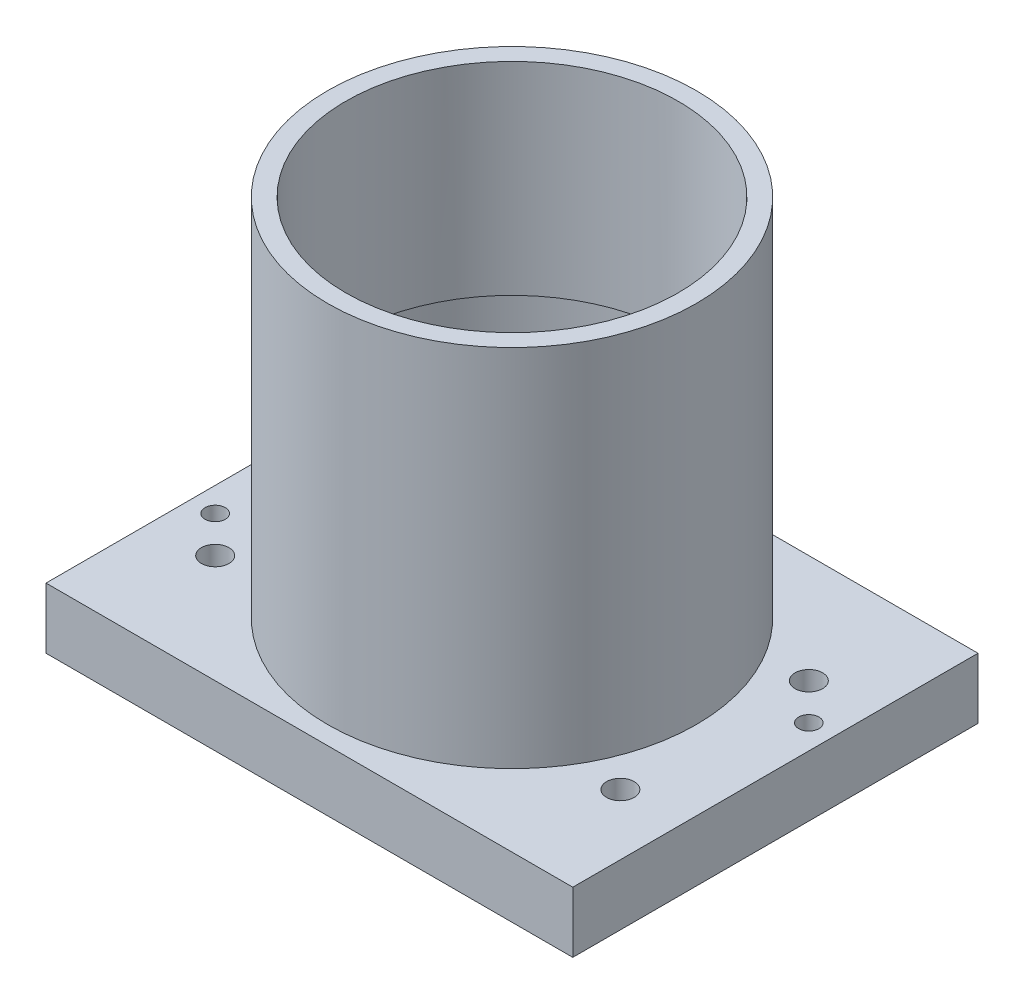
ISO-10303-21;
HEADER;
FILE_DESCRIPTION(('STEP AP214'),'2;1');
FILE_NAME('part.step','',(''),(''),'','','');
FILE_SCHEMA(('AUTOMOTIVE_DESIGN { 1 0 10303 214 1 1 1 1 }'));
ENDSEC;
DATA;
#1=APPLICATION_CONTEXT('core data for automotive mechanical design processes');
#2=APPLICATION_PROTOCOL_DEFINITION('international standard','automotive_design',2000,#1);
#3=PRODUCT_CONTEXT('',#1,'mechanical');
#4=PRODUCT('Part','Part','',(#3));
#5=PRODUCT_RELATED_PRODUCT_CATEGORY('part','',(#4));
#6=PRODUCT_DEFINITION_FORMATION('','',#4);
#7=PRODUCT_DEFINITION_CONTEXT('part definition',#1,'design');
#8=PRODUCT_DEFINITION('design','',#6,#7);
#9=PRODUCT_DEFINITION_SHAPE('','',#8);
#10=(LENGTH_UNIT() NAMED_UNIT(*) SI_UNIT(.MILLI.,.METRE.));
#11=(NAMED_UNIT(*) PLANE_ANGLE_UNIT() SI_UNIT($,.RADIAN.));
#12=(NAMED_UNIT(*) SI_UNIT($,.STERADIAN.) SOLID_ANGLE_UNIT());
#13=UNCERTAINTY_MEASURE_WITH_UNIT(LENGTH_MEASURE(1.E-05),#10,'distance_accuracy_value','');
#14=(GEOMETRIC_REPRESENTATION_CONTEXT(3) GLOBAL_UNCERTAINTY_ASSIGNED_CONTEXT((#13)) GLOBAL_UNIT_ASSIGNED_CONTEXT((#10,
#11,#12)) REPRESENTATION_CONTEXT('',''));
#15=CARTESIAN_POINT('',(0.,0.,0.));
#16=DIRECTION('',(0.,0.,1.));
#17=DIRECTION('',(1.,0.,0.));
#18=AXIS2_PLACEMENT_3D('',#15,#16,#17);
#19=CARTESIAN_POINT('',(0.,0.,0.));
#20=DIRECTION('',(0.,1.,0.));
#21=DIRECTION('',(0.,0.,1.));
#22=AXIS2_PLACEMENT_3D('',#19,#20,#21);
#23=CYLINDRICAL_SURFACE('',#22,41.);
#24=CARTESIAN_POINT('',(0.,105.,0.));
#25=DIRECTION('',(0.,1.,0.));
#26=DIRECTION('',(0.,0.,1.));
#27=AXIS2_PLACEMENT_3D('',#24,#25,#26);
#28=CIRCLE('',#27,41.);
#29=CARTESIAN_POINT('',(0.,105.,41.));
#30=VERTEX_POINT('',#29);
#31=EDGE_CURVE('E140',#30,#30,#28,.T.);
#32=ORIENTED_EDGE('',*,*,#31,.T.);
#33=EDGE_LOOP('',(#32));
#34=FACE_BOUND('',#33,.T.);
#35=CARTESIAN_POINT('',(0.,55.,0.));
#36=DIRECTION('',(0.,-1.,0.));
#37=DIRECTION('',(0.,0.,-1.));
#38=AXIS2_PLACEMENT_3D('',#35,#36,#37);
#39=CIRCLE('',#38,41.);
#40=CARTESIAN_POINT('',(0.,55.,-41.));
#41=VERTEX_POINT('',#40);
#42=EDGE_CURVE('E136',#41,#41,#39,.F.);
#43=ORIENTED_EDGE('',*,*,#42,.F.);
#44=EDGE_LOOP('',(#43));
#45=FACE_BOUND('',#44,.T.);
#46=ADVANCED_FACE('F44',(#34,#45),#23,.F.);
#47=CARTESIAN_POINT('',(65.,15.,50.));
#48=DIRECTION('',(-1.,0.,0.));
#49=DIRECTION('',(0.,0.,1.));
#50=AXIS2_PLACEMENT_3D('',#47,#48,#49);
#51=PLANE('',#50);
#52=DIRECTION('',(0.,0.,-1.));
#53=VECTOR('',#52,1.);
#54=CARTESIAN_POINT('',(65.,0.,50.));
#55=LINE('',#54,#53);
#56=CARTESIAN_POINT('',(65.,0.,50.));
#57=VERTEX_POINT('',#56);
#58=CARTESIAN_POINT('',(65.,0.,-50.));
#59=VERTEX_POINT('',#58);
#60=EDGE_CURVE('E119',#57,#59,#55,.T.);
#61=ORIENTED_EDGE('',*,*,#60,.T.);
#62=DIRECTION('',(0.,-1.,0.));
#63=VECTOR('',#62,1.);
#64=CARTESIAN_POINT('',(65.,15.,-50.));
#65=LINE('',#64,#63);
#66=CARTESIAN_POINT('',(65.,15.,-50.));
#67=VERTEX_POINT('',#66);
#68=EDGE_CURVE('E55',#67,#59,#65,.T.);
#69=ORIENTED_EDGE('',*,*,#68,.F.);
#70=DIRECTION('',(0.,0.,-1.));
#71=VECTOR('',#70,1.);
#72=CARTESIAN_POINT('',(65.,15.,50.));
#73=LINE('',#72,#71);
#74=CARTESIAN_POINT('',(65.,15.,50.));
#75=VERTEX_POINT('',#74);
#76=EDGE_CURVE('E100',#75,#67,#73,.T.);
#77=ORIENTED_EDGE('',*,*,#76,.F.);
#78=DIRECTION('',(0.,-1.,0.));
#79=VECTOR('',#78,1.);
#80=CARTESIAN_POINT('',(65.,15.,50.));
#81=LINE('',#80,#79);
#82=EDGE_CURVE('E115',#75,#57,#81,.T.);
#83=ORIENTED_EDGE('',*,*,#82,.T.);
#84=EDGE_LOOP('',(#61,#69,#77,#83));
#85=FACE_BOUND('',#84,.T.);
#86=ADVANCED_FACE('F46',(#85),#51,.F.);
#87=CARTESIAN_POINT('',(-65.,15.,-50.));
#88=DIRECTION('',(0.,0.,1.));
#89=DIRECTION('',(1.,0.,0.));
#90=AXIS2_PLACEMENT_3D('',#87,#88,#89);
#91=PLANE('',#90);
#92=DIRECTION('',(-1.,0.,0.));
#93=VECTOR('',#92,1.);
#94=CARTESIAN_POINT('',(-65.,0.,-50.));
#95=LINE('',#94,#93);
#96=CARTESIAN_POINT('',(-65.,0.,-50.));
#97=VERTEX_POINT('',#96);
#98=EDGE_CURVE('E106',#59,#97,#95,.T.);
#99=ORIENTED_EDGE('',*,*,#98,.T.);
#100=DIRECTION('',(0.,-1.,0.));
#101=VECTOR('',#100,1.);
#102=CARTESIAN_POINT('',(-65.,15.,-50.));
#103=LINE('',#102,#101);
#104=CARTESIAN_POINT('',(-65.,15.,-50.));
#105=VERTEX_POINT('',#104);
#106=EDGE_CURVE('E104',#105,#97,#103,.T.);
#107=ORIENTED_EDGE('',*,*,#106,.F.);
#108=DIRECTION('',(-1.,0.,0.));
#109=VECTOR('',#108,1.);
#110=CARTESIAN_POINT('',(-65.,15.,-50.));
#111=LINE('',#110,#109);
#112=EDGE_CURVE('E95',#67,#105,#111,.T.);
#113=ORIENTED_EDGE('',*,*,#112,.F.);
#114=ORIENTED_EDGE('',*,*,#68,.T.);
#115=EDGE_LOOP('',(#99,#107,#113,#114));
#116=FACE_BOUND('',#115,.T.);
#117=ADVANCED_FACE('F105',(#116),#91,.F.);
#118=CARTESIAN_POINT('',(-65.,15.,50.));
#119=DIRECTION('',(1.,0.,0.));
#120=DIRECTION('',(0.,0.,-1.));
#121=AXIS2_PLACEMENT_3D('',#118,#119,#120);
#122=PLANE('',#121);
#123=DIRECTION('',(0.,0.,1.));
#124=VECTOR('',#123,1.);
#125=CARTESIAN_POINT('',(-65.,0.,50.));
#126=LINE('',#125,#124);
#127=CARTESIAN_POINT('',(-65.,0.,50.));
#128=VERTEX_POINT('',#127);
#129=EDGE_CURVE('E81',#97,#128,#126,.T.);
#130=ORIENTED_EDGE('',*,*,#129,.T.);
#131=DIRECTION('',(0.,-1.,0.));
#132=VECTOR('',#131,1.);
#133=CARTESIAN_POINT('',(-65.,15.,50.));
#134=LINE('',#133,#132);
#135=CARTESIAN_POINT('',(-65.,15.,50.));
#136=VERTEX_POINT('',#135);
#137=EDGE_CURVE('E108',#136,#128,#134,.T.);
#138=ORIENTED_EDGE('',*,*,#137,.F.);
#139=DIRECTION('',(0.,0.,1.));
#140=VECTOR('',#139,1.);
#141=CARTESIAN_POINT('',(-65.,15.,50.));
#142=LINE('',#141,#140);
#143=EDGE_CURVE('E98',#105,#136,#142,.T.);
#144=ORIENTED_EDGE('',*,*,#143,.F.);
#145=ORIENTED_EDGE('',*,*,#106,.T.);
#146=EDGE_LOOP('',(#130,#138,#144,#145));
#147=FACE_BOUND('',#146,.T.);
#148=ADVANCED_FACE('F110',(#147),#122,.F.);
#149=CARTESIAN_POINT('',(-65.,15.,50.));
#150=DIRECTION('',(0.,0.,-1.));
#151=DIRECTION('',(-1.,0.,0.));
#152=AXIS2_PLACEMENT_3D('',#149,#150,#151);
#153=PLANE('',#152);
#154=DIRECTION('',(1.,0.,0.));
#155=VECTOR('',#154,1.);
#156=CARTESIAN_POINT('',(-65.,0.,50.));
#157=LINE('',#156,#155);
#158=EDGE_CURVE('E87',#128,#57,#157,.T.);
#159=ORIENTED_EDGE('',*,*,#158,.T.);
#160=ORIENTED_EDGE('',*,*,#82,.F.);
#161=DIRECTION('',(1.,0.,0.));
#162=VECTOR('',#161,1.);
#163=CARTESIAN_POINT('',(-65.,15.,50.));
#164=LINE('',#163,#162);
#165=EDGE_CURVE('E64',#136,#75,#164,.T.);
#166=ORIENTED_EDGE('',*,*,#165,.F.);
#167=ORIENTED_EDGE('',*,*,#137,.T.);
#168=EDGE_LOOP('',(#159,#160,#166,#167));
#169=FACE_BOUND('',#168,.T.);
#170=ADVANCED_FACE('F216',(#169),#153,.F.);
#171=CARTESIAN_POINT('',(0.,15.,0.));
#172=DIRECTION('',(0.,-1.,0.));
#173=DIRECTION('',(0.,0.,-1.));
#174=AXIS2_PLACEMENT_3D('',#171,#172,#173);
#175=PLANE('',#174);
#176=CARTESIAN_POINT('',(-59.,15.,14.25));
#177=DIRECTION('',(0.,-1.,0.));
#178=DIRECTION('',(0.,0.,-1.));
#179=AXIS2_PLACEMENT_3D('',#176,#177,#178);
#180=CIRCLE('',#179,2.5);
#181=CARTESIAN_POINT('',(-59.,15.,11.75));
#182=VERTEX_POINT('',#181);
#183=EDGE_CURVE('E283',#182,#182,#180,.T.);
#184=ORIENTED_EDGE('',*,*,#183,.T.);
#185=EDGE_LOOP('',(#184));
#186=FACE_BOUND('',#185,.T.);
#187=CARTESIAN_POINT('',(59.,15.,-14.25));
#188=DIRECTION('',(0.,-1.,0.));
#189=DIRECTION('',(0.,0.,-1.));
#190=AXIS2_PLACEMENT_3D('',#187,#188,#189);
#191=CIRCLE('',#190,2.5);
#192=CARTESIAN_POINT('',(59.,15.,-16.75));
#193=VERTEX_POINT('',#192);
#194=EDGE_CURVE('E285',#193,#193,#191,.T.);
#195=ORIENTED_EDGE('',*,*,#194,.T.);
#196=EDGE_LOOP('',(#195));
#197=FACE_BOUND('',#196,.T.);
#198=CARTESIAN_POINT('',(-50.,15.,-23.25));
#199=DIRECTION('',(0.,1.,0.));
#200=DIRECTION('',(0.,0.,1.));
#201=AXIS2_PLACEMENT_3D('',#198,#199,#200);
#202=CIRCLE('',#201,3.39999999999999);
#203=CARTESIAN_POINT('',(-50.,15.,-19.85));
#204=VERTEX_POINT('',#203);
#205=EDGE_CURVE('E165',#204,#204,#202,.T.);
#206=ORIENTED_EDGE('',*,*,#205,.F.);
#207=EDGE_LOOP('',(#206));
#208=FACE_BOUND('',#207,.T.);
#209=CARTESIAN_POINT('',(-50.,15.,23.25));
#210=DIRECTION('',(0.,1.,0.));
#211=DIRECTION('',(0.,0.,1.));
#212=AXIS2_PLACEMENT_3D('',#209,#210,#211);
#213=CIRCLE('',#212,3.39999999999999);
#214=CARTESIAN_POINT('',(-50.,15.,26.65));
#215=VERTEX_POINT('',#214);
#216=EDGE_CURVE('E150',#215,#215,#213,.T.);
#217=ORIENTED_EDGE('',*,*,#216,.F.);
#218=EDGE_LOOP('',(#217));
#219=FACE_BOUND('',#218,.T.);
#220=CARTESIAN_POINT('',(50.,15.,23.25));
#221=DIRECTION('',(0.,1.,0.));
#222=DIRECTION('',(0.,0.,1.));
#223=AXIS2_PLACEMENT_3D('',#220,#221,#222);
#224=CIRCLE('',#223,3.39999999999999);
#225=CARTESIAN_POINT('',(50.,15.,26.65));
#226=VERTEX_POINT('',#225);
#227=EDGE_CURVE('E146',#226,#226,#224,.T.);
#228=ORIENTED_EDGE('',*,*,#227,.F.);
#229=EDGE_LOOP('',(#228));
#230=FACE_BOUND('',#229,.T.);
#231=CARTESIAN_POINT('',(50.,15.,-23.25));
#232=DIRECTION('',(0.,1.,0.));
#233=DIRECTION('',(0.,0.,1.));
#234=AXIS2_PLACEMENT_3D('',#231,#232,#233);
#235=CIRCLE('',#234,3.39999999999999);
#236=CARTESIAN_POINT('',(50.,15.,-19.85));
#237=VERTEX_POINT('',#236);
#238=EDGE_CURVE('E145',#237,#237,#235,.T.);
#239=ORIENTED_EDGE('',*,*,#238,.F.);
#240=EDGE_LOOP('',(#239));
#241=FACE_BOUND('',#240,.T.);
#242=CARTESIAN_POINT('',(0.,15.,0.));
#243=DIRECTION('',(0.,1.,0.));
#244=DIRECTION('',(0.,0.,1.));
#245=AXIS2_PLACEMENT_3D('',#242,#243,#244);
#246=CIRCLE('',#245,45.5);
#247=CARTESIAN_POINT('',(0.,15.,45.5));
#248=VERTEX_POINT('',#247);
#249=EDGE_CURVE('E11',#248,#248,#246,.T.);
#250=ORIENTED_EDGE('',*,*,#249,.F.);
#251=EDGE_LOOP('',(#250));
#252=FACE_BOUND('',#251,.T.);
#253=ORIENTED_EDGE('',*,*,#76,.T.);
#254=ORIENTED_EDGE('',*,*,#112,.T.);
#255=ORIENTED_EDGE('',*,*,#143,.T.);
#256=ORIENTED_EDGE('',*,*,#165,.T.);
#257=EDGE_LOOP('',(#253,#254,#255,#256));
#258=FACE_BOUND('',#257,.T.);
#259=ADVANCED_FACE('F96',(#186,#197,#208,#219,#230,#241,#252,#258),#175,.F.);
#260=CARTESIAN_POINT('',(0.,0.,0.));
#261=DIRECTION('',(0.,-1.,0.));
#262=DIRECTION('',(0.,0.,-1.));
#263=AXIS2_PLACEMENT_3D('',#260,#261,#262);
#264=PLANE('',#263);
#265=CARTESIAN_POINT('',(-59.,0.,14.25));
#266=DIRECTION('',(0.,-1.,0.));
#267=DIRECTION('',(0.,0.,-1.));
#268=AXIS2_PLACEMENT_3D('',#265,#266,#267);
#269=CIRCLE('',#268,2.5);
#270=CARTESIAN_POINT('',(-59.,0.,11.75));
#271=VERTEX_POINT('',#270);
#272=EDGE_CURVE('E281',#271,#271,#269,.T.);
#273=ORIENTED_EDGE('',*,*,#272,.F.);
#274=EDGE_LOOP('',(#273));
#275=FACE_BOUND('',#274,.T.);
#276=CARTESIAN_POINT('',(59.,0.,-14.25));
#277=DIRECTION('',(0.,-1.,0.));
#278=DIRECTION('',(0.,0.,-1.));
#279=AXIS2_PLACEMENT_3D('',#276,#277,#278);
#280=CIRCLE('',#279,2.5);
#281=CARTESIAN_POINT('',(59.,0.,-16.75));
#282=VERTEX_POINT('',#281);
#283=EDGE_CURVE('E293',#282,#282,#280,.T.);
#284=ORIENTED_EDGE('',*,*,#283,.F.);
#285=EDGE_LOOP('',(#284));
#286=FACE_BOUND('',#285,.T.);
#287=CARTESIAN_POINT('',(-50.,0.,-23.25));
#288=DIRECTION('',(0.,-1.,0.));
#289=DIRECTION('',(0.,0.,-1.));
#290=AXIS2_PLACEMENT_3D('',#287,#288,#289);
#291=CIRCLE('',#290,3.39999999999999);
#292=CARTESIAN_POINT('',(-50.,0.,-26.65));
#293=VERTEX_POINT('',#292);
#294=EDGE_CURVE('E48',#293,#293,#291,.T.);
#295=ORIENTED_EDGE('',*,*,#294,.F.);
#296=EDGE_LOOP('',(#295));
#297=FACE_BOUND('',#296,.T.);
#298=CARTESIAN_POINT('',(-50.,0.,23.25));
#299=DIRECTION('',(0.,-1.,0.));
#300=DIRECTION('',(0.,0.,-1.));
#301=AXIS2_PLACEMENT_3D('',#298,#299,#300);
#302=CIRCLE('',#301,3.39999999999999);
#303=CARTESIAN_POINT('',(-50.,0.,19.85));
#304=VERTEX_POINT('',#303);
#305=EDGE_CURVE('E147',#304,#304,#302,.T.);
#306=ORIENTED_EDGE('',*,*,#305,.F.);
#307=EDGE_LOOP('',(#306));
#308=FACE_BOUND('',#307,.T.);
#309=CARTESIAN_POINT('',(50.,0.,23.25));
#310=DIRECTION('',(0.,-1.,0.));
#311=DIRECTION('',(0.,0.,-1.));
#312=AXIS2_PLACEMENT_3D('',#309,#310,#311);
#313=CIRCLE('',#312,3.39999999999999);
#314=CARTESIAN_POINT('',(50.,0.,19.85));
#315=VERTEX_POINT('',#314);
#316=EDGE_CURVE('E142',#315,#315,#313,.T.);
#317=ORIENTED_EDGE('',*,*,#316,.F.);
#318=EDGE_LOOP('',(#317));
#319=FACE_BOUND('',#318,.T.);
#320=CARTESIAN_POINT('',(50.,0.,-23.25));
#321=DIRECTION('',(0.,-1.,0.));
#322=DIRECTION('',(0.,0.,-1.));
#323=AXIS2_PLACEMENT_3D('',#320,#321,#322);
#324=CIRCLE('',#323,3.39999999999999);
#325=CARTESIAN_POINT('',(50.,0.,-26.65));
#326=VERTEX_POINT('',#325);
#327=EDGE_CURVE('E172',#326,#326,#324,.T.);
#328=ORIENTED_EDGE('',*,*,#327,.F.);
#329=EDGE_LOOP('',(#328));
#330=FACE_BOUND('',#329,.T.);
#331=CARTESIAN_POINT('',(0.,0.,0.));
#332=DIRECTION('',(0.,-1.,0.));
#333=DIRECTION('',(0.,0.,-1.));
#334=AXIS2_PLACEMENT_3D('',#331,#332,#333);
#335=CIRCLE('',#334,42.5);
#336=CARTESIAN_POINT('',(0.,0.,-42.5));
#337=VERTEX_POINT('',#336);
#338=EDGE_CURVE('E176',#337,#337,#335,.T.);
#339=ORIENTED_EDGE('',*,*,#338,.F.);
#340=EDGE_LOOP('',(#339));
#341=FACE_BOUND('',#340,.T.);
#342=ORIENTED_EDGE('',*,*,#60,.F.);
#343=ORIENTED_EDGE('',*,*,#158,.F.);
#344=ORIENTED_EDGE('',*,*,#129,.F.);
#345=ORIENTED_EDGE('',*,*,#98,.F.);
#346=EDGE_LOOP('',(#342,#343,#344,#345));
#347=FACE_BOUND('',#346,.T.);
#348=ADVANCED_FACE('F211',(#275,#286,#297,#308,#319,#330,#341,#347),#264,.T.);
#349=CARTESIAN_POINT('',(0.,105.,0.));
#350=DIRECTION('',(0.,-1.,0.));
#351=DIRECTION('',(0.,0.,-1.));
#352=AXIS2_PLACEMENT_3D('',#349,#350,#351);
#353=CYLINDRICAL_SURFACE('',#352,45.5);
#354=CARTESIAN_POINT('',(0.,105.,0.));
#355=DIRECTION('',(0.,1.,0.));
#356=DIRECTION('',(0.,0.,1.));
#357=AXIS2_PLACEMENT_3D('',#354,#355,#356);
#358=CIRCLE('',#357,45.5);
#359=CARTESIAN_POINT('',(0.,105.,45.5));
#360=VERTEX_POINT('',#359);
#361=EDGE_CURVE('E123',#360,#360,#358,.T.);
#362=ORIENTED_EDGE('',*,*,#361,.F.);
#363=EDGE_LOOP('',(#362));
#364=FACE_BOUND('',#363,.T.);
#365=ORIENTED_EDGE('',*,*,#249,.T.);
#366=EDGE_LOOP('',(#365));
#367=FACE_BOUND('',#366,.T.);
#368=ADVANCED_FACE('F208',(#364,#367),#353,.T.);
#369=CARTESIAN_POINT('',(0.,105.,0.));
#370=DIRECTION('',(0.,1.,0.));
#371=DIRECTION('',(0.,0.,1.));
#372=AXIS2_PLACEMENT_3D('',#369,#370,#371);
#373=PLANE('',#372);
#374=ORIENTED_EDGE('',*,*,#31,.F.);
#375=EDGE_LOOP('',(#374));
#376=FACE_BOUND('',#375,.T.);
#377=ORIENTED_EDGE('',*,*,#361,.T.);
#378=EDGE_LOOP('',(#377));
#379=FACE_BOUND('',#378,.T.);
#380=ADVANCED_FACE('F206',(#376,#379),#373,.T.);
#381=CARTESIAN_POINT('',(0.,55.,0.));
#382=DIRECTION('',(0.,-1.,0.));
#383=DIRECTION('',(0.,0.,-1.));
#384=AXIS2_PLACEMENT_3D('',#381,#382,#383);
#385=PLANE('',#384);
#386=CARTESIAN_POINT('',(0.,55.,0.));
#387=DIRECTION('',(0.,-1.,0.));
#388=DIRECTION('',(0.,0.,-1.));
#389=AXIS2_PLACEMENT_3D('',#386,#387,#388);
#390=CIRCLE('',#389,42.5);
#391=CARTESIAN_POINT('',(0.,55.,-42.5));
#392=VERTEX_POINT('',#391);
#393=EDGE_CURVE('E141',#392,#392,#390,.T.);
#394=ORIENTED_EDGE('',*,*,#393,.T.);
#395=EDGE_LOOP('',(#394));
#396=FACE_BOUND('',#395,.T.);
#397=ORIENTED_EDGE('',*,*,#42,.T.);
#398=EDGE_LOOP('',(#397));
#399=FACE_BOUND('',#398,.T.);
#400=ADVANCED_FACE('F241',(#396,#399),#385,.T.);
#401=CARTESIAN_POINT('',(0.,55.,0.));
#402=DIRECTION('',(0.,-1.,0.));
#403=DIRECTION('',(0.,0.,-1.));
#404=AXIS2_PLACEMENT_3D('',#401,#402,#403);
#405=CYLINDRICAL_SURFACE('',#404,42.5);
#406=ORIENTED_EDGE('',*,*,#393,.F.);
#407=EDGE_LOOP('',(#406));
#408=FACE_BOUND('',#407,.T.);
#409=ORIENTED_EDGE('',*,*,#338,.T.);
#410=EDGE_LOOP('',(#409));
#411=FACE_BOUND('',#410,.T.);
#412=ADVANCED_FACE('F238',(#408,#411),#405,.F.);
#413=CARTESIAN_POINT('',(50.,15.,-23.25));
#414=DIRECTION('',(0.,1.,0.));
#415=DIRECTION('',(0.,0.,1.));
#416=AXIS2_PLACEMENT_3D('',#413,#414,#415);
#417=CYLINDRICAL_SURFACE('',#416,3.39999999999999);
#418=ORIENTED_EDGE('',*,*,#327,.T.);
#419=EDGE_LOOP('',(#418));
#420=FACE_BOUND('',#419,.T.);
#421=ORIENTED_EDGE('',*,*,#238,.T.);
#422=EDGE_LOOP('',(#421));
#423=FACE_BOUND('',#422,.T.);
#424=ADVANCED_FACE('F251',(#420,#423),#417,.F.);
#425=CARTESIAN_POINT('',(50.,15.,23.25));
#426=DIRECTION('',(0.,1.,0.));
#427=DIRECTION('',(0.,0.,1.));
#428=AXIS2_PLACEMENT_3D('',#425,#426,#427);
#429=CYLINDRICAL_SURFACE('',#428,3.39999999999999);
#430=ORIENTED_EDGE('',*,*,#316,.T.);
#431=EDGE_LOOP('',(#430));
#432=FACE_BOUND('',#431,.T.);
#433=ORIENTED_EDGE('',*,*,#227,.T.);
#434=EDGE_LOOP('',(#433));
#435=FACE_BOUND('',#434,.T.);
#436=ADVANCED_FACE('F257',(#432,#435),#429,.F.);
#437=CARTESIAN_POINT('',(-50.,15.,23.25));
#438=DIRECTION('',(0.,1.,0.));
#439=DIRECTION('',(0.,0.,1.));
#440=AXIS2_PLACEMENT_3D('',#437,#438,#439);
#441=CYLINDRICAL_SURFACE('',#440,3.39999999999999);
#442=ORIENTED_EDGE('',*,*,#305,.T.);
#443=EDGE_LOOP('',(#442));
#444=FACE_BOUND('',#443,.T.);
#445=ORIENTED_EDGE('',*,*,#216,.T.);
#446=EDGE_LOOP('',(#445));
#447=FACE_BOUND('',#446,.T.);
#448=ADVANCED_FACE('F261',(#444,#447),#441,.F.);
#449=CARTESIAN_POINT('',(-50.,15.,-23.25));
#450=DIRECTION('',(0.,1.,0.));
#451=DIRECTION('',(0.,0.,1.));
#452=AXIS2_PLACEMENT_3D('',#449,#450,#451);
#453=CYLINDRICAL_SURFACE('',#452,3.39999999999999);
#454=ORIENTED_EDGE('',*,*,#294,.T.);
#455=EDGE_LOOP('',(#454));
#456=FACE_BOUND('',#455,.T.);
#457=ORIENTED_EDGE('',*,*,#205,.T.);
#458=EDGE_LOOP('',(#457));
#459=FACE_BOUND('',#458,.T.);
#460=ADVANCED_FACE('F265',(#456,#459),#453,.F.);
#461=CARTESIAN_POINT('',(59.,105.,-14.25));
#462=DIRECTION('',(0.,-1.,0.));
#463=DIRECTION('',(0.,0.,-1.));
#464=AXIS2_PLACEMENT_3D('',#461,#462,#463);
#465=CYLINDRICAL_SURFACE('',#464,2.5);
#466=ORIENTED_EDGE('',*,*,#283,.T.);
#467=EDGE_LOOP('',(#466));
#468=FACE_BOUND('',#467,.T.);
#469=ORIENTED_EDGE('',*,*,#194,.F.);
#470=EDGE_LOOP('',(#469));
#471=FACE_BOUND('',#470,.T.);
#472=ADVANCED_FACE('F268',(#468,#471),#465,.F.);
#473=CARTESIAN_POINT('',(-59.,105.,14.25));
#474=DIRECTION('',(0.,-1.,0.));
#475=DIRECTION('',(0.,0.,-1.));
#476=AXIS2_PLACEMENT_3D('',#473,#474,#475);
#477=CYLINDRICAL_SURFACE('',#476,2.5);
#478=ORIENTED_EDGE('',*,*,#272,.T.);
#479=EDGE_LOOP('',(#478));
#480=FACE_BOUND('',#479,.T.);
#481=ORIENTED_EDGE('',*,*,#183,.F.);
#482=EDGE_LOOP('',(#481));
#483=FACE_BOUND('',#482,.T.);
#484=ADVANCED_FACE('F272',(#480,#483),#477,.F.);
#485=CLOSED_SHELL('',(#46,#86,#117,#148,#170,#259,#348,#368,#380,#400,#412,#424,#436,#448,#460,
#472,#484));
#486=MANIFOLD_SOLID_BREP('B2',#485);
#487=ADVANCED_BREP_SHAPE_REPRESENTATION('',(#18,#486),#14);
#488=SHAPE_DEFINITION_REPRESENTATION(#9,#487);
ENDSEC;
END-ISO-10303-21;
